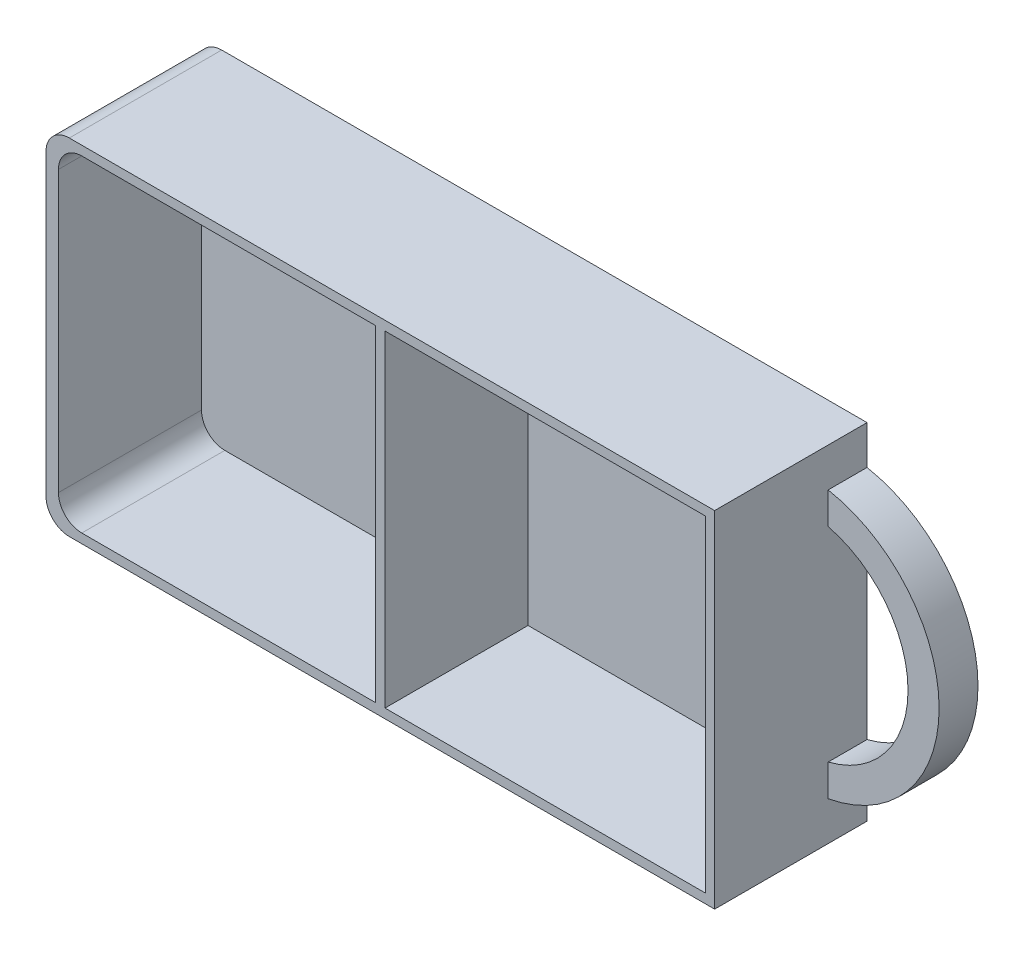
ISO-10303-21;
HEADER;
FILE_DESCRIPTION(('STEP AP214'),'2;1');
FILE_NAME('part.step','',(''),(''),'','','');
FILE_SCHEMA(('AUTOMOTIVE_DESIGN { 1 0 10303 214 1 1 1 1 }'));
ENDSEC;
DATA;
#1=APPLICATION_CONTEXT('core data for automotive mechanical design processes');
#2=APPLICATION_PROTOCOL_DEFINITION('international standard','automotive_design',2000,#1);
#3=PRODUCT_CONTEXT('',#1,'mechanical');
#4=PRODUCT('Part','Part','',(#3));
#5=PRODUCT_RELATED_PRODUCT_CATEGORY('part','',(#4));
#6=PRODUCT_DEFINITION_FORMATION('','',#4);
#7=PRODUCT_DEFINITION_CONTEXT('part definition',#1,'design');
#8=PRODUCT_DEFINITION('design','',#6,#7);
#9=PRODUCT_DEFINITION_SHAPE('','',#8);
#10=(LENGTH_UNIT() NAMED_UNIT(*) SI_UNIT(.MILLI.,.METRE.));
#11=(NAMED_UNIT(*) PLANE_ANGLE_UNIT() SI_UNIT($,.RADIAN.));
#12=(NAMED_UNIT(*) SI_UNIT($,.STERADIAN.) SOLID_ANGLE_UNIT());
#13=UNCERTAINTY_MEASURE_WITH_UNIT(LENGTH_MEASURE(1.E-05),#10,'distance_accuracy_value','');
#14=(GEOMETRIC_REPRESENTATION_CONTEXT(3) GLOBAL_UNCERTAINTY_ASSIGNED_CONTEXT((#13)) GLOBAL_UNIT_ASSIGNED_CONTEXT((#10,
#11,#12)) REPRESENTATION_CONTEXT('',''));
#15=CARTESIAN_POINT('',(0.,0.,0.));
#16=DIRECTION('',(0.,0.,1.));
#17=DIRECTION('',(1.,0.,0.));
#18=AXIS2_PLACEMENT_3D('',#15,#16,#17);
#19=CARTESIAN_POINT('',(0.,0.,19.6));
#20=DIRECTION('',(0.,0.,1.));
#21=DIRECTION('',(1.,0.,0.));
#22=AXIS2_PLACEMENT_3D('',#19,#20,#21);
#23=PLANE('',#22);
#24=DIRECTION('',(1.,0.,0.));
#25=VECTOR('',#24,1.);
#26=CARTESIAN_POINT('',(0.,-21.,19.6));
#27=LINE('',#26,#25);
#28=CARTESIAN_POINT('',(-38.4,-21.,19.6));
#29=VERTEX_POINT('',#28);
#30=CARTESIAN_POINT('',(-0.6,-21.,19.6));
#31=VERTEX_POINT('',#30);
#32=EDGE_CURVE('E194',#29,#31,#27,.T.);
#33=ORIENTED_EDGE('',*,*,#32,.F.);
#34=CARTESIAN_POINT('',(-38.4,-18.,19.6));
#35=DIRECTION('',(0.,0.,1.));
#36=DIRECTION('',(1.,0.,0.));
#37=AXIS2_PLACEMENT_3D('',#34,#35,#36);
#38=CIRCLE('',#37,3.);
#39=CARTESIAN_POINT('',(-41.4,-18.,19.6));
#40=VERTEX_POINT('',#39);
#41=EDGE_CURVE('E49',#29,#40,#38,.F.);
#42=ORIENTED_EDGE('',*,*,#41,.T.);
#43=DIRECTION('',(0.,-1.,0.));
#44=VECTOR('',#43,1.);
#45=CARTESIAN_POINT('',(-41.4,0.,19.6));
#46=LINE('',#45,#44);
#47=CARTESIAN_POINT('',(-41.4,18.,19.6));
#48=VERTEX_POINT('',#47);
#49=EDGE_CURVE('E198',#48,#40,#46,.T.);
#50=ORIENTED_EDGE('',*,*,#49,.F.);
#51=CARTESIAN_POINT('',(-38.4,18.,19.6));
#52=DIRECTION('',(0.,0.,1.));
#53=DIRECTION('',(1.,0.,0.));
#54=AXIS2_PLACEMENT_3D('',#51,#52,#53);
#55=CIRCLE('',#54,3.);
#56=CARTESIAN_POINT('',(-38.4,21.,19.6));
#57=VERTEX_POINT('',#56);
#58=EDGE_CURVE('E12',#48,#57,#55,.F.);
#59=ORIENTED_EDGE('',*,*,#58,.T.);
#60=DIRECTION('',(-1.,0.,0.));
#61=VECTOR('',#60,1.);
#62=CARTESIAN_POINT('',(0.,21.,19.6));
#63=LINE('',#62,#61);
#64=CARTESIAN_POINT('',(-0.6,21.,19.6));
#65=VERTEX_POINT('',#64);
#66=EDGE_CURVE('E181',#65,#57,#63,.T.);
#67=ORIENTED_EDGE('',*,*,#66,.F.);
#68=DIRECTION('',(0.,1.,0.));
#69=VECTOR('',#68,1.);
#70=CARTESIAN_POINT('',(-0.6,0.,19.6));
#71=LINE('',#70,#69);
#72=EDGE_CURVE('E189',#31,#65,#71,.T.);
#73=ORIENTED_EDGE('',*,*,#72,.F.);
#74=EDGE_LOOP('',(#33,#42,#50,#59,#67,#73));
#75=FACE_BOUND('',#74,.T.);
#76=DIRECTION('',(-1.,0.,0.));
#77=VECTOR('',#76,1.);
#78=CARTESIAN_POINT('',(-43.,22.2,19.6));
#79=LINE('',#78,#77);
#80=CARTESIAN_POINT('',(43.,22.2,19.6));
#81=VERTEX_POINT('',#80);
#82=CARTESIAN_POINT('',(-40.,22.2,19.6));
#83=VERTEX_POINT('',#82);
#84=EDGE_CURVE('E272',#81,#83,#79,.T.);
#85=ORIENTED_EDGE('',*,*,#84,.T.);
#86=CARTESIAN_POINT('',(-40.,19.2,19.6));
#87=DIRECTION('',(0.,0.,1.));
#88=DIRECTION('',(1.,0.,0.));
#89=AXIS2_PLACEMENT_3D('',#86,#87,#88);
#90=CIRCLE('',#89,3.);
#91=CARTESIAN_POINT('',(-43.,19.2,19.6));
#92=VERTEX_POINT('',#91);
#93=EDGE_CURVE('E310',#83,#92,#90,.T.);
#94=ORIENTED_EDGE('',*,*,#93,.T.);
#95=DIRECTION('',(0.,-1.,0.));
#96=VECTOR('',#95,1.);
#97=CARTESIAN_POINT('',(-43.,22.2,19.6));
#98=LINE('',#97,#96);
#99=CARTESIAN_POINT('',(-43.,-19.2,19.6));
#100=VERTEX_POINT('',#99);
#101=EDGE_CURVE('E276',#92,#100,#98,.T.);
#102=ORIENTED_EDGE('',*,*,#101,.T.);
#103=CARTESIAN_POINT('',(-40.,-19.2,19.6));
#104=DIRECTION('',(0.,0.,1.));
#105=DIRECTION('',(1.,0.,0.));
#106=AXIS2_PLACEMENT_3D('',#103,#104,#105);
#107=CIRCLE('',#106,3.);
#108=CARTESIAN_POINT('',(-40.,-22.2,19.6));
#109=VERTEX_POINT('',#108);
#110=EDGE_CURVE('E308',#100,#109,#107,.T.);
#111=ORIENTED_EDGE('',*,*,#110,.T.);
#112=DIRECTION('',(1.,0.,0.));
#113=VECTOR('',#112,1.);
#114=CARTESIAN_POINT('',(-43.,-22.2,19.6));
#115=LINE('',#114,#113);
#116=CARTESIAN_POINT('',(43.,-22.2,19.6));
#117=VERTEX_POINT('',#116);
#118=EDGE_CURVE('E279',#109,#117,#115,.T.);
#119=ORIENTED_EDGE('',*,*,#118,.T.);
#120=DIRECTION('',(0.,1.,0.));
#121=VECTOR('',#120,1.);
#122=CARTESIAN_POINT('',(43.,22.2,19.6));
#123=LINE('',#122,#121);
#124=EDGE_CURVE('E269',#117,#81,#123,.T.);
#125=ORIENTED_EDGE('',*,*,#124,.T.);
#126=EDGE_LOOP('',(#85,#94,#102,#111,#119,#125));
#127=FACE_BOUND('',#126,.T.);
#128=DIRECTION('',(1.,0.,0.));
#129=VECTOR('',#128,1.);
#130=CARTESIAN_POINT('',(0.,-21.,19.6));
#131=LINE('',#130,#129);
#132=CARTESIAN_POINT('',(0.6,-21.,19.6));
#133=VERTEX_POINT('',#132);
#134=CARTESIAN_POINT('',(41.8,-21.,19.6));
#135=VERTEX_POINT('',#134);
#136=EDGE_CURVE('E221',#133,#135,#131,.T.);
#137=ORIENTED_EDGE('',*,*,#136,.F.);
#138=DIRECTION('',(0.,1.,0.));
#139=VECTOR('',#138,1.);
#140=CARTESIAN_POINT('',(0.6,0.,19.6));
#141=LINE('',#140,#139);
#142=CARTESIAN_POINT('',(0.6,21.,19.6));
#143=VERTEX_POINT('',#142);
#144=EDGE_CURVE('E218',#133,#143,#141,.T.);
#145=ORIENTED_EDGE('',*,*,#144,.T.);
#146=DIRECTION('',(-1.,0.,0.));
#147=VECTOR('',#146,1.);
#148=CARTESIAN_POINT('',(0.,21.,19.6));
#149=LINE('',#148,#147);
#150=CARTESIAN_POINT('',(41.8,21.,19.6));
#151=VERTEX_POINT('',#150);
#152=EDGE_CURVE('E227',#151,#143,#149,.T.);
#153=ORIENTED_EDGE('',*,*,#152,.F.);
#154=DIRECTION('',(0.,1.,0.));
#155=VECTOR('',#154,1.);
#156=CARTESIAN_POINT('',(41.8,0.,19.6));
#157=LINE('',#156,#155);
#158=EDGE_CURVE('E224',#135,#151,#157,.T.);
#159=ORIENTED_EDGE('',*,*,#158,.F.);
#160=EDGE_LOOP('',(#137,#145,#153,#159));
#161=FACE_BOUND('',#160,.T.);
#162=ADVANCED_FACE('F41',(#75,#127,#161),#23,.T.);
#163=CARTESIAN_POINT('',(43.,22.2,19.6));
#164=DIRECTION('',(-1.,0.,0.));
#165=DIRECTION('',(0.,-1.,0.));
#166=AXIS2_PLACEMENT_3D('',#163,#164,#165);
#167=PLANE('',#166);
#168=DIRECTION('',(0.,0.,-1.));
#169=VECTOR('',#168,1.);
#170=CARTESIAN_POINT('',(43.,-17.2,5.));
#171=LINE('',#170,#169);
#172=CARTESIAN_POINT('',(43.,-17.2,5.));
#173=VERTEX_POINT('',#172);
#174=CARTESIAN_POINT('',(43.,-17.2,0.));
#175=VERTEX_POINT('',#174);
#176=EDGE_CURVE('E252',#173,#175,#171,.T.);
#177=ORIENTED_EDGE('',*,*,#176,.F.);
#178=DIRECTION('',(0.,-1.,0.));
#179=VECTOR('',#178,1.);
#180=CARTESIAN_POINT('',(43.,-17.2,5.));
#181=LINE('',#180,#179);
#182=CARTESIAN_POINT('',(43.,-13.1087756865391,5.));
#183=VERTEX_POINT('',#182);
#184=EDGE_CURVE('E249',#183,#173,#181,.T.);
#185=ORIENTED_EDGE('',*,*,#184,.F.);
#186=DIRECTION('',(0.,0.,-1.));
#187=VECTOR('',#186,1.);
#188=CARTESIAN_POINT('',(43.,-13.1087756865391,5.));
#189=LINE('',#188,#187);
#190=CARTESIAN_POINT('',(43.,-13.1087756865391,0.));
#191=VERTEX_POINT('',#190);
#192=EDGE_CURVE('E259',#183,#191,#189,.T.);
#193=ORIENTED_EDGE('',*,*,#192,.T.);
#194=DIRECTION('',(0.,1.,0.));
#195=VECTOR('',#194,1.);
#196=CARTESIAN_POINT('',(43.,22.2,0.));
#197=LINE('',#196,#195);
#198=CARTESIAN_POINT('',(43.,13.1087756865391,0.));
#199=VERTEX_POINT('',#198);
#200=EDGE_CURVE('E285',#191,#199,#197,.T.);
#201=ORIENTED_EDGE('',*,*,#200,.T.);
#202=DIRECTION('',(0.,0.,-1.));
#203=VECTOR('',#202,1.);
#204=CARTESIAN_POINT('',(43.,13.1087756865391,5.));
#205=LINE('',#204,#203);
#206=CARTESIAN_POINT('',(43.,13.1087756865391,5.));
#207=VERTEX_POINT('',#206);
#208=EDGE_CURVE('E262',#207,#199,#205,.T.);
#209=ORIENTED_EDGE('',*,*,#208,.F.);
#210=DIRECTION('',(0.,-1.,0.));
#211=VECTOR('',#210,1.);
#212=CARTESIAN_POINT('',(43.,17.2,5.));
#213=LINE('',#212,#211);
#214=CARTESIAN_POINT('',(43.,17.2,5.));
#215=VERTEX_POINT('',#214);
#216=EDGE_CURVE('E242',#215,#207,#213,.T.);
#217=ORIENTED_EDGE('',*,*,#216,.F.);
#218=DIRECTION('',(0.,0.,-1.));
#219=VECTOR('',#218,1.);
#220=CARTESIAN_POINT('',(43.,17.2,5.));
#221=LINE('',#220,#219);
#222=CARTESIAN_POINT('',(43.,17.2,0.));
#223=VERTEX_POINT('',#222);
#224=EDGE_CURVE('E265',#215,#223,#221,.T.);
#225=ORIENTED_EDGE('',*,*,#224,.T.);
#226=CARTESIAN_POINT('',(43.,22.2,0.));
#227=VERTEX_POINT('',#226);
#228=EDGE_CURVE('E268',#223,#227,#197,.T.);
#229=ORIENTED_EDGE('',*,*,#228,.T.);
#230=DIRECTION('',(0.,0.,-1.));
#231=VECTOR('',#230,1.);
#232=CARTESIAN_POINT('',(43.,22.2,19.6));
#233=LINE('',#232,#231);
#234=EDGE_CURVE('E294',#81,#227,#233,.T.);
#235=ORIENTED_EDGE('',*,*,#234,.F.);
#236=ORIENTED_EDGE('',*,*,#124,.F.);
#237=DIRECTION('',(0.,0.,-1.));
#238=VECTOR('',#237,1.);
#239=CARTESIAN_POINT('',(43.,-22.2,19.6));
#240=LINE('',#239,#238);
#241=CARTESIAN_POINT('',(43.,-22.2,0.));
#242=VERTEX_POINT('',#241);
#243=EDGE_CURVE('E281',#117,#242,#240,.T.);
#244=ORIENTED_EDGE('',*,*,#243,.T.);
#245=EDGE_CURVE('E282',#242,#175,#197,.T.);
#246=ORIENTED_EDGE('',*,*,#245,.T.);
#247=EDGE_LOOP('',(#177,#185,#193,#201,#209,#217,#225,#229,#235,#236,#244,#246));
#248=FACE_BOUND('',#247,.T.);
#249=ADVANCED_FACE('F350',(#248),#167,.F.);
#250=CARTESIAN_POINT('',(-43.,22.2,19.6));
#251=DIRECTION('',(0.,-1.,0.));
#252=DIRECTION('',(0.,0.,-1.));
#253=AXIS2_PLACEMENT_3D('',#250,#251,#252);
#254=PLANE('',#253);
#255=DIRECTION('',(-1.,0.,0.));
#256=VECTOR('',#255,1.);
#257=CARTESIAN_POINT('',(-43.,22.2,0.));
#258=LINE('',#257,#256);
#259=CARTESIAN_POINT('',(-40.,22.2,0.));
#260=VERTEX_POINT('',#259);
#261=EDGE_CURVE('E284',#227,#260,#258,.T.);
#262=ORIENTED_EDGE('',*,*,#261,.T.);
#263=DIRECTION('',(0.,0.,-1.));
#264=VECTOR('',#263,1.);
#265=CARTESIAN_POINT('',(-40.,22.2,19.6));
#266=LINE('',#265,#264);
#267=EDGE_CURVE('E306',#260,#83,#266,.F.);
#268=ORIENTED_EDGE('',*,*,#267,.T.);
#269=ORIENTED_EDGE('',*,*,#84,.F.);
#270=ORIENTED_EDGE('',*,*,#234,.T.);
#271=EDGE_LOOP('',(#262,#268,#269,#270));
#272=FACE_BOUND('',#271,.T.);
#273=ADVANCED_FACE('F355',(#272),#254,.F.);
#274=CARTESIAN_POINT('',(-43.,22.2,19.6));
#275=DIRECTION('',(1.,0.,0.));
#276=DIRECTION('',(0.,1.,0.));
#277=AXIS2_PLACEMENT_3D('',#274,#275,#276);
#278=PLANE('',#277);
#279=ORIENTED_EDGE('',*,*,#101,.F.);
#280=DIRECTION('',(0.,0.,-1.));
#281=VECTOR('',#280,1.);
#282=CARTESIAN_POINT('',(-43.,19.2,19.6));
#283=LINE('',#282,#281);
#284=CARTESIAN_POINT('',(-43.,19.2,0.));
#285=VERTEX_POINT('',#284);
#286=EDGE_CURVE('E299',#92,#285,#283,.T.);
#287=ORIENTED_EDGE('',*,*,#286,.T.);
#288=DIRECTION('',(0.,-1.,0.));
#289=VECTOR('',#288,1.);
#290=CARTESIAN_POINT('',(-43.,22.2,0.));
#291=LINE('',#290,#289);
#292=CARTESIAN_POINT('',(-43.,-19.2,0.));
#293=VERTEX_POINT('',#292);
#294=EDGE_CURVE('E288',#285,#293,#291,.T.);
#295=ORIENTED_EDGE('',*,*,#294,.T.);
#296=DIRECTION('',(0.,0.,-1.));
#297=VECTOR('',#296,1.);
#298=CARTESIAN_POINT('',(-43.,-19.2,19.6));
#299=LINE('',#298,#297);
#300=EDGE_CURVE('E297',#293,#100,#299,.F.);
#301=ORIENTED_EDGE('',*,*,#300,.T.);
#302=EDGE_LOOP('',(#279,#287,#295,#301));
#303=FACE_BOUND('',#302,.T.);
#304=ADVANCED_FACE('F369',(#303),#278,.F.);
#305=CARTESIAN_POINT('',(-43.,-22.2,19.6));
#306=DIRECTION('',(0.,1.,0.));
#307=DIRECTION('',(0.,0.,1.));
#308=AXIS2_PLACEMENT_3D('',#305,#306,#307);
#309=PLANE('',#308);
#310=ORIENTED_EDGE('',*,*,#118,.F.);
#311=DIRECTION('',(0.,0.,-1.));
#312=VECTOR('',#311,1.);
#313=CARTESIAN_POINT('',(-40.,-22.2,19.6));
#314=LINE('',#313,#312);
#315=CARTESIAN_POINT('',(-40.,-22.2,0.));
#316=VERTEX_POINT('',#315);
#317=EDGE_CURVE('E312',#109,#316,#314,.T.);
#318=ORIENTED_EDGE('',*,*,#317,.T.);
#319=DIRECTION('',(1.,0.,0.));
#320=VECTOR('',#319,1.);
#321=CARTESIAN_POINT('',(-43.,-22.2,0.));
#322=LINE('',#321,#320);
#323=EDGE_CURVE('E273',#316,#242,#322,.T.);
#324=ORIENTED_EDGE('',*,*,#323,.T.);
#325=ORIENTED_EDGE('',*,*,#243,.F.);
#326=EDGE_LOOP('',(#310,#318,#324,#325));
#327=FACE_BOUND('',#326,.T.);
#328=ADVANCED_FACE('F365',(#327),#309,.F.);
#329=CARTESIAN_POINT('',(0.,0.,0.));
#330=DIRECTION('',(0.,0.,1.));
#331=DIRECTION('',(1.,0.,0.));
#332=AXIS2_PLACEMENT_3D('',#329,#330,#331);
#333=PLANE('',#332);
#334=CARTESIAN_POINT('',(39.7735468390197,0.,0.));
#335=DIRECTION('',(0.,0.,-1.));
#336=DIRECTION('',(1.,0.,0.));
#337=AXIS2_PLACEMENT_3D('',#334,#335,#336);
#338=CIRCLE('',#337,13.5);
#339=EDGE_CURVE('E243',#199,#191,#338,.T.);
#340=ORIENTED_EDGE('',*,*,#339,.F.);
#341=ORIENTED_EDGE('',*,*,#200,.F.);
#342=EDGE_LOOP('',(#340,#341));
#343=FACE_BOUND('',#342,.T.);
#344=ORIENTED_EDGE('',*,*,#294,.F.);
#345=CARTESIAN_POINT('',(-40.,19.2,0.));
#346=DIRECTION('',(0.,0.,1.));
#347=DIRECTION('',(1.,0.,0.));
#348=AXIS2_PLACEMENT_3D('',#345,#346,#347);
#349=CIRCLE('',#348,3.);
#350=EDGE_CURVE('E304',#285,#260,#349,.F.);
#351=ORIENTED_EDGE('',*,*,#350,.T.);
#352=ORIENTED_EDGE('',*,*,#261,.F.);
#353=ORIENTED_EDGE('',*,*,#228,.F.);
#354=CARTESIAN_POINT('',(39.7735468390197,0.,0.));
#355=DIRECTION('',(0.,0.,1.));
#356=DIRECTION('',(1.,0.,0.));
#357=AXIS2_PLACEMENT_3D('',#354,#355,#356);
#358=CIRCLE('',#357,17.5);
#359=EDGE_CURVE('E207',#175,#223,#358,.T.);
#360=ORIENTED_EDGE('',*,*,#359,.F.);
#361=ORIENTED_EDGE('',*,*,#245,.F.);
#362=ORIENTED_EDGE('',*,*,#323,.F.);
#363=CARTESIAN_POINT('',(-40.,-19.2,0.));
#364=DIRECTION('',(0.,0.,1.));
#365=DIRECTION('',(1.,0.,0.));
#366=AXIS2_PLACEMENT_3D('',#363,#364,#365);
#367=CIRCLE('',#366,3.);
#368=EDGE_CURVE('E302',#316,#293,#367,.F.);
#369=ORIENTED_EDGE('',*,*,#368,.T.);
#370=EDGE_LOOP('',(#344,#351,#352,#353,#360,#361,#362,#369));
#371=FACE_BOUND('',#370,.T.);
#372=ADVANCED_FACE('F362',(#343,#371),#333,.F.);
#373=CARTESIAN_POINT('',(39.7735468390197,0.,5.));
#374=DIRECTION('',(0.,0.,-1.));
#375=DIRECTION('',(-1.,0.,0.));
#376=AXIS2_PLACEMENT_3D('',#373,#374,#375);
#377=CYLINDRICAL_SURFACE('',#376,17.5);
#378=ORIENTED_EDGE('',*,*,#359,.T.);
#379=ORIENTED_EDGE('',*,*,#224,.F.);
#380=CARTESIAN_POINT('',(39.7735468390197,0.,5.));
#381=DIRECTION('',(0.,0.,1.));
#382=DIRECTION('',(1.,0.,0.));
#383=AXIS2_PLACEMENT_3D('',#380,#381,#382);
#384=CIRCLE('',#383,17.5);
#385=EDGE_CURVE('E239',#173,#215,#384,.T.);
#386=ORIENTED_EDGE('',*,*,#385,.F.);
#387=ORIENTED_EDGE('',*,*,#176,.T.);
#388=EDGE_LOOP('',(#378,#379,#386,#387));
#389=FACE_BOUND('',#388,.T.);
#390=ADVANCED_FACE('F360',(#389),#377,.T.);
#391=CARTESIAN_POINT('',(39.7735468390197,0.,5.));
#392=DIRECTION('',(0.,0.,-1.));
#393=DIRECTION('',(-1.,0.,0.));
#394=AXIS2_PLACEMENT_3D('',#391,#392,#393);
#395=CYLINDRICAL_SURFACE('',#394,13.5);
#396=ORIENTED_EDGE('',*,*,#339,.T.);
#397=ORIENTED_EDGE('',*,*,#192,.F.);
#398=CARTESIAN_POINT('',(39.7735468390197,0.,5.));
#399=DIRECTION('',(0.,0.,-1.));
#400=DIRECTION('',(1.,0.,0.));
#401=AXIS2_PLACEMENT_3D('',#398,#399,#400);
#402=CIRCLE('',#401,13.5);
#403=EDGE_CURVE('E246',#207,#183,#402,.T.);
#404=ORIENTED_EDGE('',*,*,#403,.F.);
#405=ORIENTED_EDGE('',*,*,#208,.T.);
#406=EDGE_LOOP('',(#396,#397,#404,#405));
#407=FACE_BOUND('',#406,.T.);
#408=ADVANCED_FACE('F412',(#407),#395,.F.);
#409=CARTESIAN_POINT('',(39.7735468390197,0.,5.));
#410=DIRECTION('',(0.,0.,1.));
#411=DIRECTION('',(1.,0.,0.));
#412=AXIS2_PLACEMENT_3D('',#409,#410,#411);
#413=PLANE('',#412);
#414=ORIENTED_EDGE('',*,*,#385,.T.);
#415=ORIENTED_EDGE('',*,*,#216,.T.);
#416=ORIENTED_EDGE('',*,*,#403,.T.);
#417=ORIENTED_EDGE('',*,*,#184,.T.);
#418=EDGE_LOOP('',(#414,#415,#416,#417));
#419=FACE_BOUND('',#418,.T.);
#420=ADVANCED_FACE('F407',(#419),#413,.T.);
#421=CARTESIAN_POINT('',(0.6,0.,-58.8340037733283));
#422=DIRECTION('',(1.,0.,0.));
#423=DIRECTION('',(0.,0.,-1.));
#424=AXIS2_PLACEMENT_3D('',#421,#422,#423);
#425=PLANE('',#424);
#426=DIRECTION('',(0.,0.,1.));
#427=VECTOR('',#426,1.);
#428=CARTESIAN_POINT('',(0.6,21.,-58.8340037733283));
#429=LINE('',#428,#427);
#430=CARTESIAN_POINT('',(0.6,21.,1.2));
#431=VERTEX_POINT('',#430);
#432=EDGE_CURVE('E212',#431,#143,#429,.T.);
#433=ORIENTED_EDGE('',*,*,#432,.T.);
#434=ORIENTED_EDGE('',*,*,#144,.F.);
#435=DIRECTION('',(0.,0.,1.));
#436=VECTOR('',#435,1.);
#437=CARTESIAN_POINT('',(0.6,-21.,-58.8340037733283));
#438=LINE('',#437,#436);
#439=CARTESIAN_POINT('',(0.6,-21.,1.2));
#440=VERTEX_POINT('',#439);
#441=EDGE_CURVE('E230',#440,#133,#438,.T.);
#442=ORIENTED_EDGE('',*,*,#441,.F.);
#443=DIRECTION('',(0.,-1.,0.));
#444=VECTOR('',#443,1.);
#445=CARTESIAN_POINT('',(0.6,0.,1.2));
#446=LINE('',#445,#444);
#447=EDGE_CURVE('E214',#431,#440,#446,.T.);
#448=ORIENTED_EDGE('',*,*,#447,.F.);
#449=EDGE_LOOP('',(#433,#434,#442,#448));
#450=FACE_BOUND('',#449,.T.);
#451=ADVANCED_FACE('F418',(#450),#425,.T.);
#452=CARTESIAN_POINT('',(0.,21.,-58.8340037733283));
#453=DIRECTION('',(0.,1.,0.));
#454=DIRECTION('',(0.,0.,1.));
#455=AXIS2_PLACEMENT_3D('',#452,#453,#454);
#456=PLANE('',#455);
#457=DIRECTION('',(1.,0.,0.));
#458=VECTOR('',#457,1.);
#459=CARTESIAN_POINT('',(0.,21.,1.2));
#460=LINE('',#459,#458);
#461=CARTESIAN_POINT('',(41.8,21.,1.2));
#462=VERTEX_POINT('',#461);
#463=EDGE_CURVE('E211',#431,#462,#460,.T.);
#464=ORIENTED_EDGE('',*,*,#463,.T.);
#465=DIRECTION('',(0.,0.,1.));
#466=VECTOR('',#465,1.);
#467=CARTESIAN_POINT('',(41.8,21.,-58.8340037733283));
#468=LINE('',#467,#466);
#469=EDGE_CURVE('E232',#462,#151,#468,.T.);
#470=ORIENTED_EDGE('',*,*,#469,.T.);
#471=ORIENTED_EDGE('',*,*,#152,.T.);
#472=ORIENTED_EDGE('',*,*,#432,.F.);
#473=EDGE_LOOP('',(#464,#470,#471,#472));
#474=FACE_BOUND('',#473,.T.);
#475=ADVANCED_FACE('F423',(#474),#456,.F.);
#476=CARTESIAN_POINT('',(41.8,0.,-58.8340037733283));
#477=DIRECTION('',(1.,0.,0.));
#478=DIRECTION('',(0.,1.,0.));
#479=AXIS2_PLACEMENT_3D('',#476,#477,#478);
#480=PLANE('',#479);
#481=DIRECTION('',(0.,-1.,0.));
#482=VECTOR('',#481,1.);
#483=CARTESIAN_POINT('',(41.8,0.,1.2));
#484=LINE('',#483,#482);
#485=CARTESIAN_POINT('',(41.8,-21.,1.2));
#486=VERTEX_POINT('',#485);
#487=EDGE_CURVE('E209',#462,#486,#484,.T.);
#488=ORIENTED_EDGE('',*,*,#487,.T.);
#489=DIRECTION('',(0.,0.,1.));
#490=VECTOR('',#489,1.);
#491=CARTESIAN_POINT('',(41.8,-21.,-58.8340037733283));
#492=LINE('',#491,#490);
#493=EDGE_CURVE('E234',#486,#135,#492,.T.);
#494=ORIENTED_EDGE('',*,*,#493,.T.);
#495=ORIENTED_EDGE('',*,*,#158,.T.);
#496=ORIENTED_EDGE('',*,*,#469,.F.);
#497=EDGE_LOOP('',(#488,#494,#495,#496));
#498=FACE_BOUND('',#497,.T.);
#499=ADVANCED_FACE('F429',(#498),#480,.F.);
#500=CARTESIAN_POINT('',(0.,-21.,-58.8340037733283));
#501=DIRECTION('',(0.,-1.,0.));
#502=DIRECTION('',(0.,0.,-1.));
#503=AXIS2_PLACEMENT_3D('',#500,#501,#502);
#504=PLANE('',#503);
#505=DIRECTION('',(-1.,0.,0.));
#506=VECTOR('',#505,1.);
#507=CARTESIAN_POINT('',(0.,-21.,1.2));
#508=LINE('',#507,#506);
#509=EDGE_CURVE('E217',#486,#440,#508,.T.);
#510=ORIENTED_EDGE('',*,*,#509,.T.);
#511=ORIENTED_EDGE('',*,*,#441,.T.);
#512=ORIENTED_EDGE('',*,*,#136,.T.);
#513=ORIENTED_EDGE('',*,*,#493,.F.);
#514=EDGE_LOOP('',(#510,#511,#512,#513));
#515=FACE_BOUND('',#514,.T.);
#516=ADVANCED_FACE('F425',(#515),#504,.F.);
#517=CARTESIAN_POINT('',(0.,0.,1.2));
#518=DIRECTION('',(0.,0.,1.));
#519=DIRECTION('',(1.,0.,0.));
#520=AXIS2_PLACEMENT_3D('',#517,#518,#519);
#521=PLANE('',#520);
#522=ORIENTED_EDGE('',*,*,#463,.F.);
#523=ORIENTED_EDGE('',*,*,#447,.T.);
#524=ORIENTED_EDGE('',*,*,#509,.F.);
#525=ORIENTED_EDGE('',*,*,#487,.F.);
#526=EDGE_LOOP('',(#522,#523,#524,#525));
#527=FACE_BOUND('',#526,.T.);
#528=ADVANCED_FACE('F428',(#527),#521,.T.);
#529=CARTESIAN_POINT('',(0.,-21.,-58.8340037733283));
#530=DIRECTION('',(0.,-1.,0.));
#531=DIRECTION('',(0.,0.,-1.));
#532=AXIS2_PLACEMENT_3D('',#529,#530,#531);
#533=PLANE('',#532);
#534=DIRECTION('',(-1.,0.,0.));
#535=VECTOR('',#534,1.);
#536=CARTESIAN_POINT('',(0.,-21.,1.2));
#537=LINE('',#536,#535);
#538=CARTESIAN_POINT('',(-0.6,-21.,1.2));
#539=VERTEX_POINT('',#538);
#540=CARTESIAN_POINT('',(-38.4,-21.,1.2));
#541=VERTEX_POINT('',#540);
#542=EDGE_CURVE('E208',#539,#541,#537,.T.);
#543=ORIENTED_EDGE('',*,*,#542,.T.);
#544=DIRECTION('',(0.,0.,1.));
#545=VECTOR('',#544,1.);
#546=CARTESIAN_POINT('',(-38.4,-21.,19.6));
#547=LINE('',#546,#545);
#548=EDGE_CURVE('E315',#541,#29,#547,.T.);
#549=ORIENTED_EDGE('',*,*,#548,.T.);
#550=ORIENTED_EDGE('',*,*,#32,.T.);
#551=DIRECTION('',(0.,0.,1.));
#552=VECTOR('',#551,1.);
#553=CARTESIAN_POINT('',(-0.6,-21.,-58.8340037733283));
#554=LINE('',#553,#552);
#555=EDGE_CURVE('E185',#539,#31,#554,.T.);
#556=ORIENTED_EDGE('',*,*,#555,.F.);
#557=EDGE_LOOP('',(#543,#549,#550,#556));
#558=FACE_BOUND('',#557,.T.);
#559=ADVANCED_FACE('F339',(#558),#533,.F.);
#560=CARTESIAN_POINT('',(-41.4,0.,-58.8340037733283));
#561=DIRECTION('',(-1.,0.,0.));
#562=DIRECTION('',(0.,-1.,0.));
#563=AXIS2_PLACEMENT_3D('',#560,#561,#562);
#564=PLANE('',#563);
#565=ORIENTED_EDGE('',*,*,#49,.T.);
#566=DIRECTION('',(0.,0.,1.));
#567=VECTOR('',#566,1.);
#568=CARTESIAN_POINT('',(-41.4,-18.,1.2));
#569=LINE('',#568,#567);
#570=CARTESIAN_POINT('',(-41.4,-18.,1.2));
#571=VERTEX_POINT('',#570);
#572=EDGE_CURVE('E321',#40,#571,#569,.F.);
#573=ORIENTED_EDGE('',*,*,#572,.T.);
#574=DIRECTION('',(0.,1.,0.));
#575=VECTOR('',#574,1.);
#576=CARTESIAN_POINT('',(-41.4,0.,1.2));
#577=LINE('',#576,#575);
#578=CARTESIAN_POINT('',(-41.4,18.,1.2));
#579=VERTEX_POINT('',#578);
#580=EDGE_CURVE('E337',#571,#579,#577,.T.);
#581=ORIENTED_EDGE('',*,*,#580,.T.);
#582=DIRECTION('',(0.,0.,1.));
#583=VECTOR('',#582,1.);
#584=CARTESIAN_POINT('',(-41.4,18.,19.6));
#585=LINE('',#584,#583);
#586=EDGE_CURVE('E318',#579,#48,#585,.T.);
#587=ORIENTED_EDGE('',*,*,#586,.T.);
#588=EDGE_LOOP('',(#565,#573,#581,#587));
#589=FACE_BOUND('',#588,.T.);
#590=ADVANCED_FACE('F330',(#589),#564,.F.);
#591=CARTESIAN_POINT('',(0.,21.,-58.8340037733283));
#592=DIRECTION('',(0.,1.,0.));
#593=DIRECTION('',(0.,0.,1.));
#594=AXIS2_PLACEMENT_3D('',#591,#592,#593);
#595=PLANE('',#594);
#596=ORIENTED_EDGE('',*,*,#66,.T.);
#597=DIRECTION('',(0.,0.,1.));
#598=VECTOR('',#597,1.);
#599=CARTESIAN_POINT('',(-38.4,21.,1.2));
#600=LINE('',#599,#598);
#601=CARTESIAN_POINT('',(-38.4,21.,1.2));
#602=VERTEX_POINT('',#601);
#603=EDGE_CURVE('E56',#57,#602,#600,.F.);
#604=ORIENTED_EDGE('',*,*,#603,.T.);
#605=DIRECTION('',(1.,0.,0.));
#606=VECTOR('',#605,1.);
#607=CARTESIAN_POINT('',(0.,21.,1.2));
#608=LINE('',#607,#606);
#609=CARTESIAN_POINT('',(-0.6,21.,1.2));
#610=VERTEX_POINT('',#609);
#611=EDGE_CURVE('E182',#602,#610,#608,.T.);
#612=ORIENTED_EDGE('',*,*,#611,.T.);
#613=DIRECTION('',(0.,0.,1.));
#614=VECTOR('',#613,1.);
#615=CARTESIAN_POINT('',(-0.6,21.,-58.8340037733283));
#616=LINE('',#615,#614);
#617=EDGE_CURVE('E177',#610,#65,#616,.T.);
#618=ORIENTED_EDGE('',*,*,#617,.T.);
#619=EDGE_LOOP('',(#596,#604,#612,#618));
#620=FACE_BOUND('',#619,.T.);
#621=ADVANCED_FACE('F179',(#620),#595,.F.);
#622=CARTESIAN_POINT('',(-0.6,0.,-58.8340037733283));
#623=DIRECTION('',(1.,0.,0.));
#624=DIRECTION('',(0.,0.,-1.));
#625=AXIS2_PLACEMENT_3D('',#622,#623,#624);
#626=PLANE('',#625);
#627=DIRECTION('',(0.,-1.,0.));
#628=VECTOR('',#627,1.);
#629=CARTESIAN_POINT('',(-0.6,0.,1.2));
#630=LINE('',#629,#628);
#631=EDGE_CURVE('E205',#610,#539,#630,.T.);
#632=ORIENTED_EDGE('',*,*,#631,.T.);
#633=ORIENTED_EDGE('',*,*,#555,.T.);
#634=ORIENTED_EDGE('',*,*,#72,.T.);
#635=ORIENTED_EDGE('',*,*,#617,.F.);
#636=EDGE_LOOP('',(#632,#633,#634,#635));
#637=FACE_BOUND('',#636,.T.);
#638=ADVANCED_FACE('F190',(#637),#626,.F.);
#639=CARTESIAN_POINT('',(0.,0.,1.2));
#640=DIRECTION('',(0.,0.,1.));
#641=DIRECTION('',(1.,0.,0.));
#642=AXIS2_PLACEMENT_3D('',#639,#640,#641);
#643=PLANE('',#642);
#644=ORIENTED_EDGE('',*,*,#580,.F.);
#645=CARTESIAN_POINT('',(-38.4,-18.,1.2));
#646=DIRECTION('',(0.,0.,1.));
#647=DIRECTION('',(1.,0.,0.));
#648=AXIS2_PLACEMENT_3D('',#645,#646,#647);
#649=CIRCLE('',#648,3.);
#650=EDGE_CURVE('E324',#571,#541,#649,.T.);
#651=ORIENTED_EDGE('',*,*,#650,.T.);
#652=ORIENTED_EDGE('',*,*,#542,.F.);
#653=ORIENTED_EDGE('',*,*,#631,.F.);
#654=ORIENTED_EDGE('',*,*,#611,.F.);
#655=CARTESIAN_POINT('',(-38.4,18.,1.2));
#656=DIRECTION('',(0.,0.,1.));
#657=DIRECTION('',(1.,0.,0.));
#658=AXIS2_PLACEMENT_3D('',#655,#656,#657);
#659=CIRCLE('',#658,3.);
#660=EDGE_CURVE('E63',#602,#579,#659,.T.);
#661=ORIENTED_EDGE('',*,*,#660,.T.);
#662=EDGE_LOOP('',(#644,#651,#652,#653,#654,#661));
#663=FACE_BOUND('',#662,.T.);
#664=ADVANCED_FACE('F336',(#663),#643,.T.);
#665=CARTESIAN_POINT('',(-40.,19.2,19.6));
#666=DIRECTION('',(0.,0.,-1.));
#667=DIRECTION('',(-1.,0.,0.));
#668=AXIS2_PLACEMENT_3D('',#665,#666,#667);
#669=CYLINDRICAL_SURFACE('',#668,3.);
#670=ORIENTED_EDGE('',*,*,#93,.F.);
#671=ORIENTED_EDGE('',*,*,#267,.F.);
#672=ORIENTED_EDGE('',*,*,#350,.F.);
#673=ORIENTED_EDGE('',*,*,#286,.F.);
#674=EDGE_LOOP('',(#670,#671,#672,#673));
#675=FACE_BOUND('',#674,.T.);
#676=ADVANCED_FACE('F377',(#675),#669,.T.);
#677=CARTESIAN_POINT('',(-40.,-19.2,19.6));
#678=DIRECTION('',(0.,0.,-1.));
#679=DIRECTION('',(-1.,0.,0.));
#680=AXIS2_PLACEMENT_3D('',#677,#678,#679);
#681=CYLINDRICAL_SURFACE('',#680,3.);
#682=ORIENTED_EDGE('',*,*,#110,.F.);
#683=ORIENTED_EDGE('',*,*,#300,.F.);
#684=ORIENTED_EDGE('',*,*,#368,.F.);
#685=ORIENTED_EDGE('',*,*,#317,.F.);
#686=EDGE_LOOP('',(#682,#683,#684,#685));
#687=FACE_BOUND('',#686,.T.);
#688=ADVANCED_FACE('F348',(#687),#681,.T.);
#689=CARTESIAN_POINT('',(-38.4,-18.,-58.8340037733283));
#690=DIRECTION('',(0.,0.,-1.));
#691=DIRECTION('',(-1.,0.,0.));
#692=AXIS2_PLACEMENT_3D('',#689,#690,#691);
#693=CYLINDRICAL_SURFACE('',#692,3.);
#694=ORIENTED_EDGE('',*,*,#650,.F.);
#695=ORIENTED_EDGE('',*,*,#572,.F.);
#696=ORIENTED_EDGE('',*,*,#41,.F.);
#697=ORIENTED_EDGE('',*,*,#548,.F.);
#698=EDGE_LOOP('',(#694,#695,#696,#697));
#699=FACE_BOUND('',#698,.T.);
#700=ADVANCED_FACE('F333',(#699),#693,.F.);
#701=CARTESIAN_POINT('',(-38.4,18.,-58.8340037733283));
#702=DIRECTION('',(0.,0.,-1.));
#703=DIRECTION('',(-1.,0.,0.));
#704=AXIS2_PLACEMENT_3D('',#701,#702,#703);
#705=CYLINDRICAL_SURFACE('',#704,3.);
#706=ORIENTED_EDGE('',*,*,#660,.F.);
#707=ORIENTED_EDGE('',*,*,#603,.F.);
#708=ORIENTED_EDGE('',*,*,#58,.F.);
#709=ORIENTED_EDGE('',*,*,#586,.F.);
#710=EDGE_LOOP('',(#706,#707,#708,#709));
#711=FACE_BOUND('',#710,.T.);
#712=ADVANCED_FACE('F43',(#711),#705,.F.);
#713=CLOSED_SHELL('',(#162,#249,#273,#304,#328,#372,#390,#408,#420,#451,#475,#499,#516,#528,
#559,#590,#621,#638,#664,#676,#688,#700,#712));
#714=MANIFOLD_SOLID_BREP('B2',#713);
#715=ADVANCED_BREP_SHAPE_REPRESENTATION('',(#18,#714),#14);
#716=SHAPE_DEFINITION_REPRESENTATION(#9,#715);
ENDSEC;
END-ISO-10303-21;
